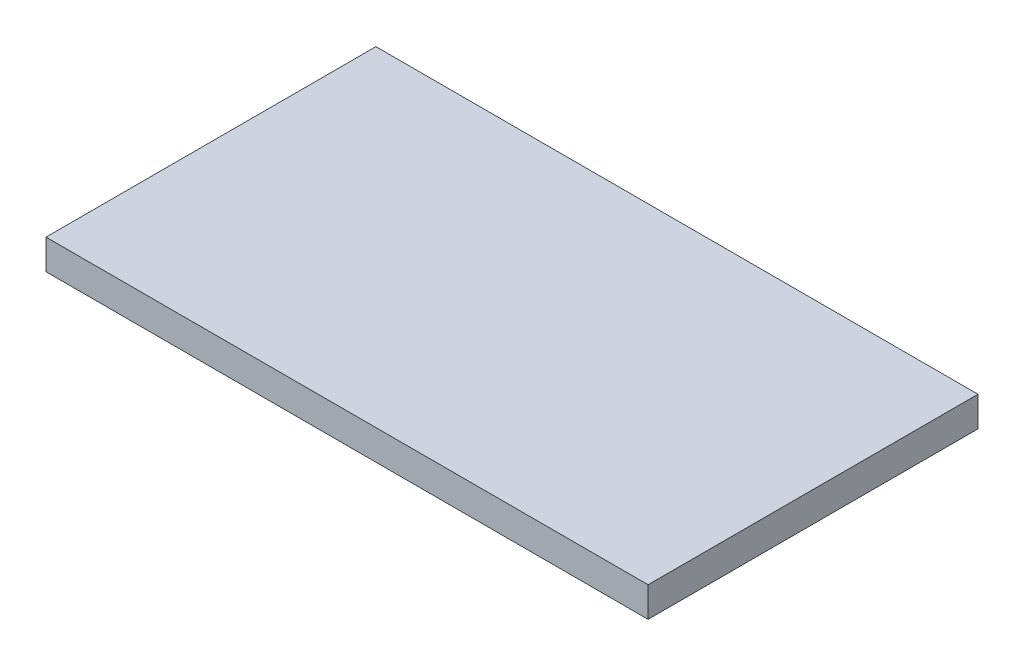
ISO-10303-21;
HEADER;
FILE_DESCRIPTION(('STEP AP214'),'2;1');
FILE_NAME('part.step','',(''),(''),'','','');
FILE_SCHEMA(('AUTOMOTIVE_DESIGN { 1 0 10303 214 1 1 1 1 }'));
ENDSEC;
DATA;
#1=APPLICATION_CONTEXT('core data for automotive mechanical design processes');
#2=APPLICATION_PROTOCOL_DEFINITION('international standard','automotive_design',2000,#1);
#3=PRODUCT_CONTEXT('',#1,'mechanical');
#4=PRODUCT('Part','Part','',(#3));
#5=PRODUCT_RELATED_PRODUCT_CATEGORY('part','',(#4));
#6=PRODUCT_DEFINITION_FORMATION('','',#4);
#7=PRODUCT_DEFINITION_CONTEXT('part definition',#1,'design');
#8=PRODUCT_DEFINITION('design','',#6,#7);
#9=PRODUCT_DEFINITION_SHAPE('','',#8);
#10=(LENGTH_UNIT() NAMED_UNIT(*) SI_UNIT(.MILLI.,.METRE.));
#11=(NAMED_UNIT(*) PLANE_ANGLE_UNIT() SI_UNIT($,.RADIAN.));
#12=(NAMED_UNIT(*) SI_UNIT($,.STERADIAN.) SOLID_ANGLE_UNIT());
#13=UNCERTAINTY_MEASURE_WITH_UNIT(LENGTH_MEASURE(1.E-05),#10,'distance_accuracy_value','');
#14=(GEOMETRIC_REPRESENTATION_CONTEXT(3) GLOBAL_UNCERTAINTY_ASSIGNED_CONTEXT((#13)) GLOBAL_UNIT_ASSIGNED_CONTEXT((#10,
#11,#12)) REPRESENTATION_CONTEXT('',''));
#15=CARTESIAN_POINT('',(0.,0.,0.));
#16=DIRECTION('',(0.,0.,1.));
#17=DIRECTION('',(1.,0.,0.));
#18=AXIS2_PLACEMENT_3D('',#15,#16,#17);
#19=CARTESIAN_POINT('',(0.,10.,0.));
#20=DIRECTION('',(1.,0.,0.));
#21=DIRECTION('',(0.,0.,-1.));
#22=AXIS2_PLACEMENT_3D('',#19,#20,#21);
#23=PLANE('',#22);
#24=DIRECTION('',(0.,0.,1.));
#25=VECTOR('',#24,1.);
#26=CARTESIAN_POINT('',(0.,0.,0.));
#27=LINE('',#26,#25);
#28=CARTESIAN_POINT('',(0.,0.,0.));
#29=VERTEX_POINT('',#28);
#30=CARTESIAN_POINT('',(0.,0.,110.));
#31=VERTEX_POINT('',#30);
#32=EDGE_CURVE('E99',#29,#31,#27,.T.);
#33=ORIENTED_EDGE('',*,*,#32,.T.);
#34=DIRECTION('',(0.,-1.,0.));
#35=VECTOR('',#34,1.);
#36=CARTESIAN_POINT('',(0.,10.,110.));
#37=LINE('',#36,#35);
#38=CARTESIAN_POINT('',(0.,10.,110.));
#39=VERTEX_POINT('',#38);
#40=EDGE_CURVE('E11',#39,#31,#37,.T.);
#41=ORIENTED_EDGE('',*,*,#40,.F.);
#42=DIRECTION('',(0.,0.,1.));
#43=VECTOR('',#42,1.);
#44=CARTESIAN_POINT('',(0.,10.,0.));
#45=LINE('',#44,#43);
#46=CARTESIAN_POINT('',(0.,10.,0.));
#47=VERTEX_POINT('',#46);
#48=EDGE_CURVE('E87',#47,#39,#45,.T.);
#49=ORIENTED_EDGE('',*,*,#48,.F.);
#50=DIRECTION('',(0.,-1.,0.));
#51=VECTOR('',#50,1.);
#52=CARTESIAN_POINT('',(0.,10.,0.));
#53=LINE('',#52,#51);
#54=EDGE_CURVE('E95',#47,#29,#53,.T.);
#55=ORIENTED_EDGE('',*,*,#54,.T.);
#56=EDGE_LOOP('',(#33,#41,#49,#55));
#57=FACE_BOUND('',#56,.T.);
#58=ADVANCED_FACE('F36',(#57),#23,.F.);
#59=CARTESIAN_POINT('',(0.,10.,110.));
#60=DIRECTION('',(0.,0.,-1.));
#61=DIRECTION('',(-1.,0.,0.));
#62=AXIS2_PLACEMENT_3D('',#59,#60,#61);
#63=PLANE('',#62);
#64=DIRECTION('',(1.,0.,0.));
#65=VECTOR('',#64,1.);
#66=CARTESIAN_POINT('',(0.,0.,110.));
#67=LINE('',#66,#65);
#68=CARTESIAN_POINT('',(200.75,0.,110.));
#69=VERTEX_POINT('',#68);
#70=EDGE_CURVE('E91',#31,#69,#67,.T.);
#71=ORIENTED_EDGE('',*,*,#70,.T.);
#72=DIRECTION('',(0.,-1.,0.));
#73=VECTOR('',#72,1.);
#74=CARTESIAN_POINT('',(200.75,10.,110.));
#75=LINE('',#74,#73);
#76=CARTESIAN_POINT('',(200.75,10.,110.));
#77=VERTEX_POINT('',#76);
#78=EDGE_CURVE('E44',#77,#69,#75,.T.);
#79=ORIENTED_EDGE('',*,*,#78,.F.);
#80=DIRECTION('',(1.,0.,0.));
#81=VECTOR('',#80,1.);
#82=CARTESIAN_POINT('',(0.,10.,110.));
#83=LINE('',#82,#81);
#84=EDGE_CURVE('E82',#39,#77,#83,.T.);
#85=ORIENTED_EDGE('',*,*,#84,.F.);
#86=ORIENTED_EDGE('',*,*,#40,.T.);
#87=EDGE_LOOP('',(#71,#79,#85,#86));
#88=FACE_BOUND('',#87,.T.);
#89=ADVANCED_FACE('F90',(#88),#63,.F.);
#90=CARTESIAN_POINT('',(200.75,10.,0.));
#91=DIRECTION('',(-1.,0.,0.));
#92=DIRECTION('',(0.,0.,1.));
#93=AXIS2_PLACEMENT_3D('',#90,#91,#92);
#94=PLANE('',#93);
#95=DIRECTION('',(0.,0.,-1.));
#96=VECTOR('',#95,1.);
#97=CARTESIAN_POINT('',(200.75,0.,0.));
#98=LINE('',#97,#96);
#99=CARTESIAN_POINT('',(200.75,0.,0.));
#100=VERTEX_POINT('',#99);
#101=EDGE_CURVE('E69',#69,#100,#98,.T.);
#102=ORIENTED_EDGE('',*,*,#101,.T.);
#103=DIRECTION('',(0.,-1.,0.));
#104=VECTOR('',#103,1.);
#105=CARTESIAN_POINT('',(200.75,10.,0.));
#106=LINE('',#105,#104);
#107=CARTESIAN_POINT('',(200.75,10.,0.));
#108=VERTEX_POINT('',#107);
#109=EDGE_CURVE('E92',#108,#100,#106,.T.);
#110=ORIENTED_EDGE('',*,*,#109,.F.);
#111=DIRECTION('',(0.,0.,-1.));
#112=VECTOR('',#111,1.);
#113=CARTESIAN_POINT('',(200.75,10.,0.));
#114=LINE('',#113,#112);
#115=EDGE_CURVE('E85',#77,#108,#114,.T.);
#116=ORIENTED_EDGE('',*,*,#115,.F.);
#117=ORIENTED_EDGE('',*,*,#78,.T.);
#118=EDGE_LOOP('',(#102,#110,#116,#117));
#119=FACE_BOUND('',#118,.T.);
#120=ADVANCED_FACE('F93',(#119),#94,.F.);
#121=CARTESIAN_POINT('',(0.,10.,0.));
#122=DIRECTION('',(0.,0.,1.));
#123=DIRECTION('',(1.,0.,0.));
#124=AXIS2_PLACEMENT_3D('',#121,#122,#123);
#125=PLANE('',#124);
#126=DIRECTION('',(-1.,0.,0.));
#127=VECTOR('',#126,1.);
#128=CARTESIAN_POINT('',(0.,0.,0.));
#129=LINE('',#128,#127);
#130=EDGE_CURVE('E75',#100,#29,#129,.T.);
#131=ORIENTED_EDGE('',*,*,#130,.T.);
#132=ORIENTED_EDGE('',*,*,#54,.F.);
#133=DIRECTION('',(-1.,0.,0.));
#134=VECTOR('',#133,1.);
#135=CARTESIAN_POINT('',(0.,10.,0.));
#136=LINE('',#135,#134);
#137=EDGE_CURVE('E52',#108,#47,#136,.T.);
#138=ORIENTED_EDGE('',*,*,#137,.F.);
#139=ORIENTED_EDGE('',*,*,#109,.T.);
#140=EDGE_LOOP('',(#131,#132,#138,#139));
#141=FACE_BOUND('',#140,.T.);
#142=ADVANCED_FACE('F106',(#141),#125,.F.);
#143=CARTESIAN_POINT('',(0.,10.,0.));
#144=DIRECTION('',(0.,1.,0.));
#145=DIRECTION('',(0.,0.,1.));
#146=AXIS2_PLACEMENT_3D('',#143,#144,#145);
#147=PLANE('',#146);
#148=ORIENTED_EDGE('',*,*,#48,.T.);
#149=ORIENTED_EDGE('',*,*,#84,.T.);
#150=ORIENTED_EDGE('',*,*,#115,.T.);
#151=ORIENTED_EDGE('',*,*,#137,.T.);
#152=EDGE_LOOP('',(#148,#149,#150,#151));
#153=FACE_BOUND('',#152,.T.);
#154=ADVANCED_FACE('F83',(#153),#147,.T.);
#155=CARTESIAN_POINT('',(0.,0.,0.));
#156=DIRECTION('',(0.,1.,0.));
#157=DIRECTION('',(0.,0.,1.));
#158=AXIS2_PLACEMENT_3D('',#155,#156,#157);
#159=PLANE('',#158);
#160=ORIENTED_EDGE('',*,*,#32,.F.);
#161=ORIENTED_EDGE('',*,*,#130,.F.);
#162=ORIENTED_EDGE('',*,*,#101,.F.);
#163=ORIENTED_EDGE('',*,*,#70,.F.);
#164=EDGE_LOOP('',(#160,#161,#162,#163));
#165=FACE_BOUND('',#164,.T.);
#166=ADVANCED_FACE('F109',(#165),#159,.F.);
#167=CLOSED_SHELL('',(#58,#89,#120,#142,#154,#166));
#168=MANIFOLD_SOLID_BREP('B2',#167);
#169=ADVANCED_BREP_SHAPE_REPRESENTATION('',(#18,#168),#14);
#170=SHAPE_DEFINITION_REPRESENTATION(#9,#169);
ENDSEC;
END-ISO-10303-21;
